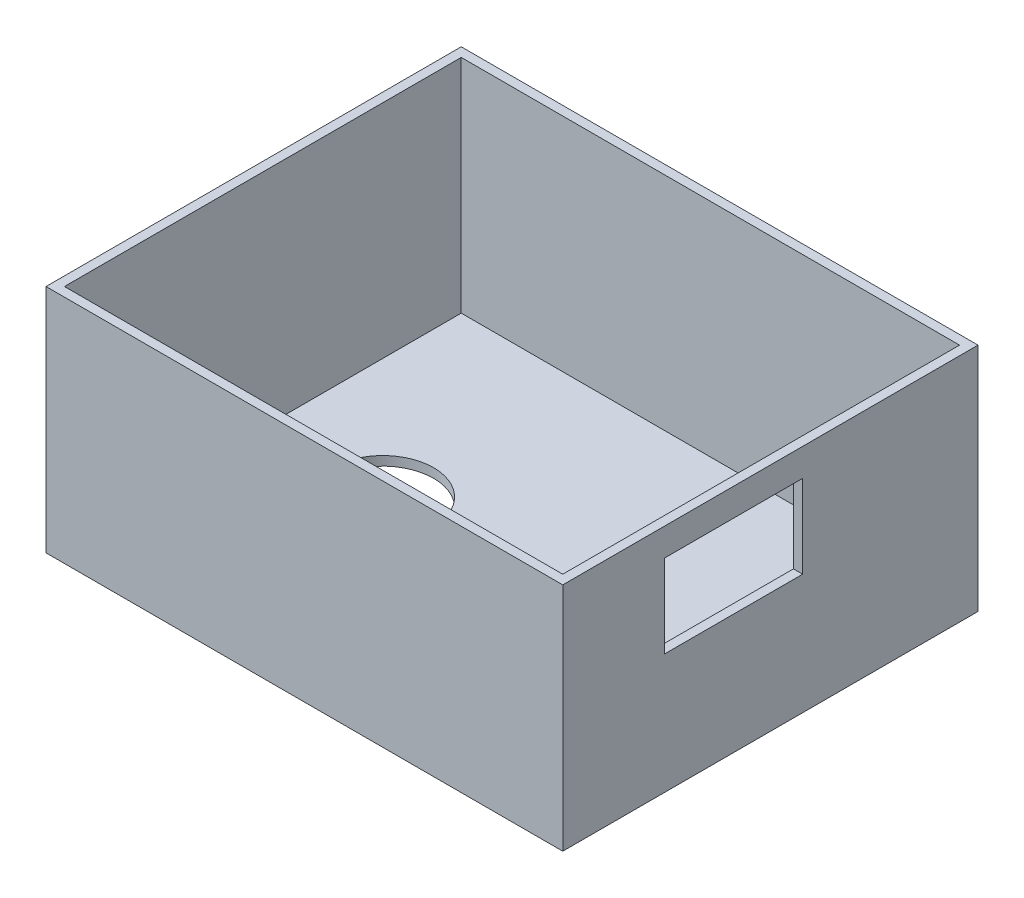
ISO-10303-21;
HEADER;
FILE_DESCRIPTION(('STEP AP214'),'2;1');
FILE_NAME('part.step','',(''),(''),'','','');
FILE_SCHEMA(('AUTOMOTIVE_DESIGN { 1 0 10303 214 1 1 1 1 }'));
ENDSEC;
DATA;
#1=APPLICATION_CONTEXT('core data for automotive mechanical design processes');
#2=APPLICATION_PROTOCOL_DEFINITION('international standard','automotive_design',2000,#1);
#3=PRODUCT_CONTEXT('',#1,'mechanical');
#4=PRODUCT('Part','Part','',(#3));
#5=PRODUCT_RELATED_PRODUCT_CATEGORY('part','',(#4));
#6=PRODUCT_DEFINITION_FORMATION('','',#4);
#7=PRODUCT_DEFINITION_CONTEXT('part definition',#1,'design');
#8=PRODUCT_DEFINITION('design','',#6,#7);
#9=PRODUCT_DEFINITION_SHAPE('','',#8);
#10=(LENGTH_UNIT() NAMED_UNIT(*) SI_UNIT(.MILLI.,.METRE.));
#11=(NAMED_UNIT(*) PLANE_ANGLE_UNIT() SI_UNIT($,.RADIAN.));
#12=(NAMED_UNIT(*) SI_UNIT($,.STERADIAN.) SOLID_ANGLE_UNIT());
#13=UNCERTAINTY_MEASURE_WITH_UNIT(LENGTH_MEASURE(1.E-05),#10,'distance_accuracy_value','');
#14=(GEOMETRIC_REPRESENTATION_CONTEXT(3) GLOBAL_UNCERTAINTY_ASSIGNED_CONTEXT((#13)) GLOBAL_UNIT_ASSIGNED_CONTEXT((#10,
#11,#12)) REPRESENTATION_CONTEXT('',''));
#15=CARTESIAN_POINT('',(0.,0.,0.));
#16=DIRECTION('',(0.,0.,1.));
#17=DIRECTION('',(1.,0.,0.));
#18=AXIS2_PLACEMENT_3D('',#15,#16,#17);
#19=CARTESIAN_POINT('',(-14.,15.,0.));
#20=DIRECTION('',(0.,-1.,0.));
#21=DIRECTION('',(0.,0.,-1.));
#22=AXIS2_PLACEMENT_3D('',#19,#20,#21);
#23=CYLINDRICAL_SURFACE('',#22,5.5);
#24=CARTESIAN_POINT('',(-14.,0.,0.));
#25=DIRECTION('',(0.,-1.,0.));
#26=DIRECTION('',(0.,0.,-1.));
#27=AXIS2_PLACEMENT_3D('',#24,#25,#26);
#28=CIRCLE('',#27,5.5);
#29=CARTESIAN_POINT('',(-14.,0.,-5.5));
#30=VERTEX_POINT('',#29);
#31=EDGE_CURVE('E184',#30,#30,#28,.T.);
#32=ORIENTED_EDGE('',*,*,#31,.T.);
#33=EDGE_LOOP('',(#32));
#34=FACE_BOUND('',#33,.T.);
#35=CARTESIAN_POINT('',(-14.,1.,0.));
#36=DIRECTION('',(0.,1.,0.));
#37=DIRECTION('',(0.,0.,1.));
#38=AXIS2_PLACEMENT_3D('',#35,#36,#37);
#39=CIRCLE('',#38,5.5);
#40=CARTESIAN_POINT('',(-14.,1.,5.5));
#41=VERTEX_POINT('',#40);
#42=EDGE_CURVE('E177',#41,#41,#39,.F.);
#43=ORIENTED_EDGE('',*,*,#42,.F.);
#44=EDGE_LOOP('',(#43));
#45=FACE_BOUND('',#44,.T.);
#46=ADVANCED_FACE('F35',(#34,#45),#23,.F.);
#47=CARTESIAN_POINT('',(28.,25.,-22.5));
#48=DIRECTION('',(-1.,0.,0.));
#49=DIRECTION('',(0.,0.,1.));
#50=AXIS2_PLACEMENT_3D('',#47,#48,#49);
#51=PLANE('',#50);
#52=DIRECTION('',(0.,0.,1.));
#53=VECTOR('',#52,1.);
#54=CARTESIAN_POINT('',(28.,22.,11.5));
#55=LINE('',#54,#53);
#56=CARTESIAN_POINT('',(28.,22.,-3.5));
#57=VERTEX_POINT('',#56);
#58=CARTESIAN_POINT('',(28.,22.,11.5));
#59=VERTEX_POINT('',#58);
#60=EDGE_CURVE('E136',#57,#59,#55,.T.);
#61=ORIENTED_EDGE('',*,*,#60,.F.);
#62=DIRECTION('',(0.,1.,0.));
#63=VECTOR('',#62,1.);
#64=CARTESIAN_POINT('',(28.,22.,-3.5));
#65=LINE('',#64,#63);
#66=CARTESIAN_POINT('',(28.,13.,-3.5));
#67=VERTEX_POINT('',#66);
#68=EDGE_CURVE('E50',#67,#57,#65,.T.);
#69=ORIENTED_EDGE('',*,*,#68,.F.);
#70=DIRECTION('',(0.,0.,-1.));
#71=VECTOR('',#70,1.);
#72=CARTESIAN_POINT('',(28.,13.,11.5));
#73=LINE('',#72,#71);
#74=CARTESIAN_POINT('',(28.,13.,11.5));
#75=VERTEX_POINT('',#74);
#76=EDGE_CURVE('E142',#75,#67,#73,.T.);
#77=ORIENTED_EDGE('',*,*,#76,.F.);
#78=DIRECTION('',(0.,-1.,0.));
#79=VECTOR('',#78,1.);
#80=CARTESIAN_POINT('',(28.,22.,11.5));
#81=LINE('',#80,#79);
#82=EDGE_CURVE('E127',#59,#75,#81,.T.);
#83=ORIENTED_EDGE('',*,*,#82,.F.);
#84=EDGE_LOOP('',(#61,#69,#77,#83));
#85=FACE_BOUND('',#84,.T.);
#86=DIRECTION('',(0.,0.,-1.));
#87=VECTOR('',#86,1.);
#88=CARTESIAN_POINT('',(28.,0.,-22.5));
#89=LINE('',#88,#87);
#90=CARTESIAN_POINT('',(28.,0.,22.5));
#91=VERTEX_POINT('',#90);
#92=CARTESIAN_POINT('',(28.,0.,-22.5));
#93=VERTEX_POINT('',#92);
#94=EDGE_CURVE('E187',#91,#93,#89,.T.);
#95=ORIENTED_EDGE('',*,*,#94,.T.);
#96=DIRECTION('',(0.,-1.,0.));
#97=VECTOR('',#96,1.);
#98=CARTESIAN_POINT('',(28.,25.,-22.5));
#99=LINE('',#98,#97);
#100=CARTESIAN_POINT('',(28.,25.,-22.5));
#101=VERTEX_POINT('',#100);
#102=EDGE_CURVE('E214',#101,#93,#99,.T.);
#103=ORIENTED_EDGE('',*,*,#102,.F.);
#104=DIRECTION('',(0.,0.,-1.));
#105=VECTOR('',#104,1.);
#106=CARTESIAN_POINT('',(28.,25.,-22.5));
#107=LINE('',#106,#105);
#108=CARTESIAN_POINT('',(28.,25.,22.5));
#109=VERTEX_POINT('',#108);
#110=EDGE_CURVE('E188',#109,#101,#107,.T.);
#111=ORIENTED_EDGE('',*,*,#110,.F.);
#112=DIRECTION('',(0.,-1.,0.));
#113=VECTOR('',#112,1.);
#114=CARTESIAN_POINT('',(28.,25.,22.5));
#115=LINE('',#114,#113);
#116=EDGE_CURVE('E198',#109,#91,#115,.T.);
#117=ORIENTED_EDGE('',*,*,#116,.T.);
#118=EDGE_LOOP('',(#95,#103,#111,#117));
#119=FACE_BOUND('',#118,.T.);
#120=ADVANCED_FACE('F37',(#85,#119),#51,.F.);
#121=CARTESIAN_POINT('',(-28.,25.,-22.5));
#122=DIRECTION('',(0.,0.,1.));
#123=DIRECTION('',(1.,0.,0.));
#124=AXIS2_PLACEMENT_3D('',#121,#122,#123);
#125=PLANE('',#124);
#126=DIRECTION('',(-1.,0.,0.));
#127=VECTOR('',#126,1.);
#128=CARTESIAN_POINT('',(-28.,0.,-22.5));
#129=LINE('',#128,#127);
#130=CARTESIAN_POINT('',(-28.,0.,-22.5));
#131=VERTEX_POINT('',#130);
#132=EDGE_CURVE('E201',#93,#131,#129,.T.);
#133=ORIENTED_EDGE('',*,*,#132,.T.);
#134=DIRECTION('',(0.,-1.,0.));
#135=VECTOR('',#134,1.);
#136=CARTESIAN_POINT('',(-28.,25.,-22.5));
#137=LINE('',#136,#135);
#138=CARTESIAN_POINT('',(-28.,25.,-22.5));
#139=VERTEX_POINT('',#138);
#140=EDGE_CURVE('E211',#139,#131,#137,.T.);
#141=ORIENTED_EDGE('',*,*,#140,.F.);
#142=DIRECTION('',(-1.,0.,0.));
#143=VECTOR('',#142,1.);
#144=CARTESIAN_POINT('',(-28.,25.,-22.5));
#145=LINE('',#144,#143);
#146=EDGE_CURVE('E191',#101,#139,#145,.T.);
#147=ORIENTED_EDGE('',*,*,#146,.F.);
#148=ORIENTED_EDGE('',*,*,#102,.T.);
#149=EDGE_LOOP('',(#133,#141,#147,#148));
#150=FACE_BOUND('',#149,.T.);
#151=ADVANCED_FACE('F248',(#150),#125,.F.);
#152=CARTESIAN_POINT('',(-28.,25.,-22.5));
#153=DIRECTION('',(1.,0.,0.));
#154=DIRECTION('',(0.,0.,-1.));
#155=AXIS2_PLACEMENT_3D('',#152,#153,#154);
#156=PLANE('',#155);
#157=DIRECTION('',(0.,0.,1.));
#158=VECTOR('',#157,1.);
#159=CARTESIAN_POINT('',(-28.,0.,-22.5));
#160=LINE('',#159,#158);
#161=CARTESIAN_POINT('',(-28.,0.,22.5));
#162=VERTEX_POINT('',#161);
#163=EDGE_CURVE('E203',#131,#162,#160,.T.);
#164=ORIENTED_EDGE('',*,*,#163,.T.);
#165=DIRECTION('',(0.,-1.,0.));
#166=VECTOR('',#165,1.);
#167=CARTESIAN_POINT('',(-28.,25.,22.5));
#168=LINE('',#167,#166);
#169=CARTESIAN_POINT('',(-28.,25.,22.5));
#170=VERTEX_POINT('',#169);
#171=EDGE_CURVE('E208',#170,#162,#168,.T.);
#172=ORIENTED_EDGE('',*,*,#171,.F.);
#173=DIRECTION('',(0.,0.,1.));
#174=VECTOR('',#173,1.);
#175=CARTESIAN_POINT('',(-28.,25.,-22.5));
#176=LINE('',#175,#174);
#177=EDGE_CURVE('E194',#139,#170,#176,.T.);
#178=ORIENTED_EDGE('',*,*,#177,.F.);
#179=ORIENTED_EDGE('',*,*,#140,.T.);
#180=EDGE_LOOP('',(#164,#172,#178,#179));
#181=FACE_BOUND('',#180,.T.);
#182=ADVANCED_FACE('F264',(#181),#156,.F.);
#183=CARTESIAN_POINT('',(-28.,25.,22.5));
#184=DIRECTION('',(0.,0.,-1.));
#185=DIRECTION('',(-1.,0.,0.));
#186=AXIS2_PLACEMENT_3D('',#183,#184,#185);
#187=PLANE('',#186);
#188=DIRECTION('',(1.,0.,0.));
#189=VECTOR('',#188,1.);
#190=CARTESIAN_POINT('',(-28.,0.,22.5));
#191=LINE('',#190,#189);
#192=EDGE_CURVE('E192',#162,#91,#191,.T.);
#193=ORIENTED_EDGE('',*,*,#192,.T.);
#194=ORIENTED_EDGE('',*,*,#116,.F.);
#195=DIRECTION('',(1.,0.,0.));
#196=VECTOR('',#195,1.);
#197=CARTESIAN_POINT('',(-28.,25.,22.5));
#198=LINE('',#197,#196);
#199=EDGE_CURVE('E196',#170,#109,#198,.T.);
#200=ORIENTED_EDGE('',*,*,#199,.F.);
#201=ORIENTED_EDGE('',*,*,#171,.T.);
#202=EDGE_LOOP('',(#193,#194,#200,#201));
#203=FACE_BOUND('',#202,.T.);
#204=ADVANCED_FACE('F256',(#203),#187,.F.);
#205=CARTESIAN_POINT('',(0.,25.,0.));
#206=DIRECTION('',(0.,1.,0.));
#207=DIRECTION('',(0.,0.,1.));
#208=AXIS2_PLACEMENT_3D('',#205,#206,#207);
#209=PLANE('',#208);
#210=DIRECTION('',(0.,0.,-1.));
#211=VECTOR('',#210,1.);
#212=CARTESIAN_POINT('',(27.,25.,-21.5));
#213=LINE('',#212,#211);
#214=CARTESIAN_POINT('',(27.,25.,21.5));
#215=VERTEX_POINT('',#214);
#216=CARTESIAN_POINT('',(27.,25.,-21.5));
#217=VERTEX_POINT('',#216);
#218=EDGE_CURVE('E149',#215,#217,#213,.T.);
#219=ORIENTED_EDGE('',*,*,#218,.F.);
#220=DIRECTION('',(1.,0.,0.));
#221=VECTOR('',#220,1.);
#222=CARTESIAN_POINT('',(-27.,25.,21.5));
#223=LINE('',#222,#221);
#224=CARTESIAN_POINT('',(-27.,25.,21.5));
#225=VERTEX_POINT('',#224);
#226=EDGE_CURVE('E156',#225,#215,#223,.T.);
#227=ORIENTED_EDGE('',*,*,#226,.F.);
#228=DIRECTION('',(0.,0.,1.));
#229=VECTOR('',#228,1.);
#230=CARTESIAN_POINT('',(-27.,25.,-21.5));
#231=LINE('',#230,#229);
#232=CARTESIAN_POINT('',(-27.,25.,-21.5));
#233=VERTEX_POINT('',#232);
#234=EDGE_CURVE('E170',#233,#225,#231,.T.);
#235=ORIENTED_EDGE('',*,*,#234,.F.);
#236=DIRECTION('',(-1.,0.,0.));
#237=VECTOR('',#236,1.);
#238=CARTESIAN_POINT('',(-27.,25.,-21.5));
#239=LINE('',#238,#237);
#240=EDGE_CURVE('E167',#217,#233,#239,.T.);
#241=ORIENTED_EDGE('',*,*,#240,.F.);
#242=EDGE_LOOP('',(#219,#227,#235,#241));
#243=FACE_BOUND('',#242,.T.);
#244=ORIENTED_EDGE('',*,*,#110,.T.);
#245=ORIENTED_EDGE('',*,*,#146,.T.);
#246=ORIENTED_EDGE('',*,*,#177,.T.);
#247=ORIENTED_EDGE('',*,*,#199,.T.);
#248=EDGE_LOOP('',(#244,#245,#246,#247));
#249=FACE_BOUND('',#248,.T.);
#250=ADVANCED_FACE('F252',(#243,#249),#209,.T.);
#251=CARTESIAN_POINT('',(0.,0.,0.));
#252=DIRECTION('',(0.,1.,0.));
#253=DIRECTION('',(0.,0.,1.));
#254=AXIS2_PLACEMENT_3D('',#251,#252,#253);
#255=PLANE('',#254);
#256=ORIENTED_EDGE('',*,*,#31,.F.);
#257=EDGE_LOOP('',(#256));
#258=FACE_BOUND('',#257,.T.);
#259=ORIENTED_EDGE('',*,*,#94,.F.);
#260=ORIENTED_EDGE('',*,*,#192,.F.);
#261=ORIENTED_EDGE('',*,*,#163,.F.);
#262=ORIENTED_EDGE('',*,*,#132,.F.);
#263=EDGE_LOOP('',(#259,#260,#261,#262));
#264=FACE_BOUND('',#263,.T.);
#265=ADVANCED_FACE('F255',(#258,#264),#255,.F.);
#266=CARTESIAN_POINT('',(0.,1.,0.));
#267=DIRECTION('',(0.,1.,0.));
#268=DIRECTION('',(0.,0.,1.));
#269=AXIS2_PLACEMENT_3D('',#266,#267,#268);
#270=PLANE('',#269);
#271=DIRECTION('',(0.,0.,-1.));
#272=VECTOR('',#271,1.);
#273=CARTESIAN_POINT('',(27.,1.,-21.5));
#274=LINE('',#273,#272);
#275=CARTESIAN_POINT('',(27.,1.,21.5));
#276=VERTEX_POINT('',#275);
#277=CARTESIAN_POINT('',(27.,1.,-21.5));
#278=VERTEX_POINT('',#277);
#279=EDGE_CURVE('E152',#276,#278,#274,.T.);
#280=ORIENTED_EDGE('',*,*,#279,.T.);
#281=DIRECTION('',(-1.,0.,0.));
#282=VECTOR('',#281,1.);
#283=CARTESIAN_POINT('',(-27.,1.,-21.5));
#284=LINE('',#283,#282);
#285=CARTESIAN_POINT('',(-27.,1.,-21.5));
#286=VERTEX_POINT('',#285);
#287=EDGE_CURVE('E155',#278,#286,#284,.T.);
#288=ORIENTED_EDGE('',*,*,#287,.T.);
#289=DIRECTION('',(0.,0.,1.));
#290=VECTOR('',#289,1.);
#291=CARTESIAN_POINT('',(-27.,1.,-21.5));
#292=LINE('',#291,#290);
#293=CARTESIAN_POINT('',(-27.,1.,21.5));
#294=VERTEX_POINT('',#293);
#295=EDGE_CURVE('E159',#286,#294,#292,.T.);
#296=ORIENTED_EDGE('',*,*,#295,.T.);
#297=DIRECTION('',(1.,0.,0.));
#298=VECTOR('',#297,1.);
#299=CARTESIAN_POINT('',(-27.,1.,21.5));
#300=LINE('',#299,#298);
#301=EDGE_CURVE('E162',#294,#276,#300,.T.);
#302=ORIENTED_EDGE('',*,*,#301,.T.);
#303=EDGE_LOOP('',(#280,#288,#296,#302));
#304=FACE_BOUND('',#303,.T.);
#305=ORIENTED_EDGE('',*,*,#42,.T.);
#306=EDGE_LOOP('',(#305));
#307=FACE_BOUND('',#306,.T.);
#308=ADVANCED_FACE('F260',(#304,#307),#270,.T.);
#309=CARTESIAN_POINT('',(27.,1.,-21.5));
#310=DIRECTION('',(1.,0.,0.));
#311=DIRECTION('',(0.,0.,-1.));
#312=AXIS2_PLACEMENT_3D('',#309,#310,#311);
#313=PLANE('',#312);
#314=DIRECTION('',(0.,0.,-1.));
#315=VECTOR('',#314,1.);
#316=CARTESIAN_POINT('',(27.,13.,-21.5));
#317=LINE('',#316,#315);
#318=CARTESIAN_POINT('',(27.,13.,11.5));
#319=VERTEX_POINT('',#318);
#320=CARTESIAN_POINT('',(27.,13.,-3.5));
#321=VERTEX_POINT('',#320);
#322=EDGE_CURVE('E43',#319,#321,#317,.T.);
#323=ORIENTED_EDGE('',*,*,#322,.T.);
#324=DIRECTION('',(0.,1.,0.));
#325=VECTOR('',#324,1.);
#326=CARTESIAN_POINT('',(27.,0.999999999999999,-3.5));
#327=LINE('',#326,#325);
#328=CARTESIAN_POINT('',(27.,22.,-3.5));
#329=VERTEX_POINT('',#328);
#330=EDGE_CURVE('E11',#321,#329,#327,.T.);
#331=ORIENTED_EDGE('',*,*,#330,.T.);
#332=DIRECTION('',(0.,0.,1.));
#333=VECTOR('',#332,1.);
#334=CARTESIAN_POINT('',(27.,22.,-21.5));
#335=LINE('',#334,#333);
#336=CARTESIAN_POINT('',(27.,22.,11.5));
#337=VERTEX_POINT('',#336);
#338=EDGE_CURVE('E217',#329,#337,#335,.T.);
#339=ORIENTED_EDGE('',*,*,#338,.T.);
#340=DIRECTION('',(0.,-1.,0.));
#341=VECTOR('',#340,1.);
#342=CARTESIAN_POINT('',(27.,1.,11.5));
#343=LINE('',#342,#341);
#344=EDGE_CURVE('E130',#337,#319,#343,.T.);
#345=ORIENTED_EDGE('',*,*,#344,.T.);
#346=EDGE_LOOP('',(#323,#331,#339,#345));
#347=FACE_BOUND('',#346,.T.);
#348=ORIENTED_EDGE('',*,*,#218,.T.);
#349=DIRECTION('',(0.,1.,0.));
#350=VECTOR('',#349,1.);
#351=CARTESIAN_POINT('',(27.,1.,-21.5));
#352=LINE('',#351,#350);
#353=EDGE_CURVE('E165',#278,#217,#352,.T.);
#354=ORIENTED_EDGE('',*,*,#353,.F.);
#355=ORIENTED_EDGE('',*,*,#279,.F.);
#356=DIRECTION('',(0.,1.,0.));
#357=VECTOR('',#356,1.);
#358=CARTESIAN_POINT('',(27.,1.,21.5));
#359=LINE('',#358,#357);
#360=EDGE_CURVE('E175',#276,#215,#359,.T.);
#361=ORIENTED_EDGE('',*,*,#360,.T.);
#362=EDGE_LOOP('',(#348,#354,#355,#361));
#363=FACE_BOUND('',#362,.T.);
#364=ADVANCED_FACE('F223',(#347,#363),#313,.F.);
#365=CARTESIAN_POINT('',(-27.,1.,21.5));
#366=DIRECTION('',(0.,0.,1.));
#367=DIRECTION('',(1.,0.,0.));
#368=AXIS2_PLACEMENT_3D('',#365,#366,#367);
#369=PLANE('',#368);
#370=ORIENTED_EDGE('',*,*,#226,.T.);
#371=ORIENTED_EDGE('',*,*,#360,.F.);
#372=ORIENTED_EDGE('',*,*,#301,.F.);
#373=DIRECTION('',(0.,1.,0.));
#374=VECTOR('',#373,1.);
#375=CARTESIAN_POINT('',(-27.,1.,21.5));
#376=LINE('',#375,#374);
#377=EDGE_CURVE('E178',#294,#225,#376,.T.);
#378=ORIENTED_EDGE('',*,*,#377,.T.);
#379=EDGE_LOOP('',(#370,#371,#372,#378));
#380=FACE_BOUND('',#379,.T.);
#381=ADVANCED_FACE('F315',(#380),#369,.F.);
#382=CARTESIAN_POINT('',(-27.,1.,-21.5));
#383=DIRECTION('',(-1.,0.,0.));
#384=DIRECTION('',(0.,0.,1.));
#385=AXIS2_PLACEMENT_3D('',#382,#383,#384);
#386=PLANE('',#385);
#387=ORIENTED_EDGE('',*,*,#234,.T.);
#388=ORIENTED_EDGE('',*,*,#377,.F.);
#389=ORIENTED_EDGE('',*,*,#295,.F.);
#390=DIRECTION('',(0.,1.,0.));
#391=VECTOR('',#390,1.);
#392=CARTESIAN_POINT('',(-27.,1.,-21.5));
#393=LINE('',#392,#391);
#394=EDGE_CURVE('E180',#286,#233,#393,.T.);
#395=ORIENTED_EDGE('',*,*,#394,.T.);
#396=EDGE_LOOP('',(#387,#388,#389,#395));
#397=FACE_BOUND('',#396,.T.);
#398=ADVANCED_FACE('F237',(#397),#386,.F.);
#399=CARTESIAN_POINT('',(-27.,1.,-21.5));
#400=DIRECTION('',(0.,0.,-1.));
#401=DIRECTION('',(-1.,0.,0.));
#402=AXIS2_PLACEMENT_3D('',#399,#400,#401);
#403=PLANE('',#402);
#404=ORIENTED_EDGE('',*,*,#240,.T.);
#405=ORIENTED_EDGE('',*,*,#394,.F.);
#406=ORIENTED_EDGE('',*,*,#287,.F.);
#407=ORIENTED_EDGE('',*,*,#353,.T.);
#408=EDGE_LOOP('',(#404,#405,#406,#407));
#409=FACE_BOUND('',#408,.T.);
#410=ADVANCED_FACE('F230',(#409),#403,.F.);
#411=CARTESIAN_POINT('',(4.,22.,-3.5));
#412=DIRECTION('',(0.,0.,-1.));
#413=DIRECTION('',(0.,1.,0.));
#414=AXIS2_PLACEMENT_3D('',#411,#412,#413);
#415=PLANE('',#414);
#416=DIRECTION('',(1.,0.,0.));
#417=VECTOR('',#416,1.);
#418=CARTESIAN_POINT('',(4.,13.,-3.5));
#419=LINE('',#418,#417);
#420=EDGE_CURVE('E147',#321,#67,#419,.T.);
#421=ORIENTED_EDGE('',*,*,#420,.T.);
#422=ORIENTED_EDGE('',*,*,#68,.T.);
#423=DIRECTION('',(1.,0.,0.));
#424=VECTOR('',#423,1.);
#425=CARTESIAN_POINT('',(4.,22.,-3.5));
#426=LINE('',#425,#424);
#427=EDGE_CURVE('E133',#329,#57,#426,.T.);
#428=ORIENTED_EDGE('',*,*,#427,.F.);
#429=ORIENTED_EDGE('',*,*,#330,.F.);
#430=EDGE_LOOP('',(#421,#422,#428,#429));
#431=FACE_BOUND('',#430,.T.);
#432=ADVANCED_FACE('F228',(#431),#415,.F.);
#433=CARTESIAN_POINT('',(4.,13.,11.5));
#434=DIRECTION('',(0.,-1.,0.));
#435=DIRECTION('',(0.,0.,-1.));
#436=AXIS2_PLACEMENT_3D('',#433,#434,#435);
#437=PLANE('',#436);
#438=DIRECTION('',(1.,0.,0.));
#439=VECTOR('',#438,1.);
#440=CARTESIAN_POINT('',(4.,13.,11.5));
#441=LINE('',#440,#439);
#442=EDGE_CURVE('E132',#319,#75,#441,.T.);
#443=ORIENTED_EDGE('',*,*,#442,.T.);
#444=ORIENTED_EDGE('',*,*,#76,.T.);
#445=ORIENTED_EDGE('',*,*,#420,.F.);
#446=ORIENTED_EDGE('',*,*,#322,.F.);
#447=EDGE_LOOP('',(#443,#444,#445,#446));
#448=FACE_BOUND('',#447,.T.);
#449=ADVANCED_FACE('F227',(#448),#437,.F.);
#450=CARTESIAN_POINT('',(4.,22.,11.5));
#451=DIRECTION('',(0.,0.,1.));
#452=DIRECTION('',(1.,0.,0.));
#453=AXIS2_PLACEMENT_3D('',#450,#451,#452);
#454=PLANE('',#453);
#455=DIRECTION('',(1.,0.,0.));
#456=VECTOR('',#455,1.);
#457=CARTESIAN_POINT('',(4.,22.,11.5));
#458=LINE('',#457,#456);
#459=EDGE_CURVE('E58',#337,#59,#458,.T.);
#460=ORIENTED_EDGE('',*,*,#459,.T.);
#461=ORIENTED_EDGE('',*,*,#82,.T.);
#462=ORIENTED_EDGE('',*,*,#442,.F.);
#463=ORIENTED_EDGE('',*,*,#344,.F.);
#464=EDGE_LOOP('',(#460,#461,#462,#463));
#465=FACE_BOUND('',#464,.T.);
#466=ADVANCED_FACE('F124',(#465),#454,.F.);
#467=CARTESIAN_POINT('',(4.,22.,11.5));
#468=DIRECTION('',(0.,1.,0.));
#469=DIRECTION('',(0.,0.,1.));
#470=AXIS2_PLACEMENT_3D('',#467,#468,#469);
#471=PLANE('',#470);
#472=ORIENTED_EDGE('',*,*,#427,.T.);
#473=ORIENTED_EDGE('',*,*,#60,.T.);
#474=ORIENTED_EDGE('',*,*,#459,.F.);
#475=ORIENTED_EDGE('',*,*,#338,.F.);
#476=EDGE_LOOP('',(#472,#473,#474,#475));
#477=FACE_BOUND('',#476,.T.);
#478=ADVANCED_FACE('F137',(#477),#471,.F.);
#479=CLOSED_SHELL('',(#46,#120,#151,#182,#204,#250,#265,#308,#364,#381,#398,#410,#432,#449,#466,#478));
#480=MANIFOLD_SOLID_BREP('B2',#479);
#481=ADVANCED_BREP_SHAPE_REPRESENTATION('',(#18,#480),#14);
#482=SHAPE_DEFINITION_REPRESENTATION(#9,#481);
ENDSEC;
END-ISO-10303-21;
